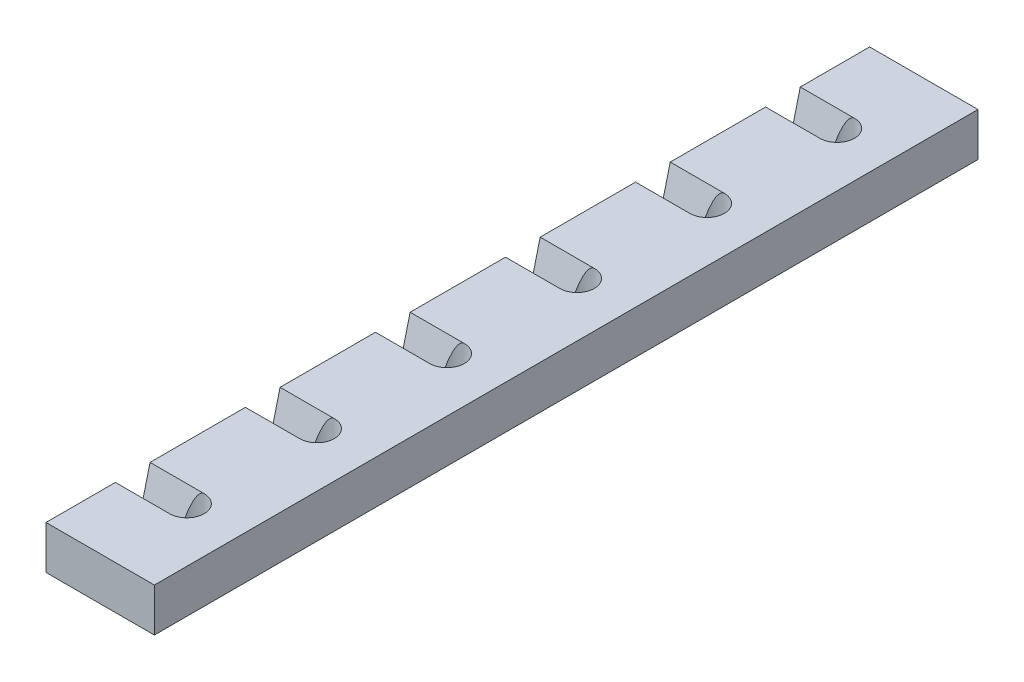
ISO-10303-21;
HEADER;
FILE_DESCRIPTION(('STEP AP214'),'2;1');
FILE_NAME('part.step','',(''),(''),'','','');
FILE_SCHEMA(('AUTOMOTIVE_DESIGN { 1 0 10303 214 1 1 1 1 }'));
ENDSEC;
DATA;
#1=APPLICATION_CONTEXT('core data for automotive mechanical design processes');
#2=APPLICATION_PROTOCOL_DEFINITION('international standard','automotive_design',2000,#1);
#3=PRODUCT_CONTEXT('',#1,'mechanical');
#4=PRODUCT('Part','Part','',(#3));
#5=PRODUCT_RELATED_PRODUCT_CATEGORY('part','',(#4));
#6=PRODUCT_DEFINITION_FORMATION('','',#4);
#7=PRODUCT_DEFINITION_CONTEXT('part definition',#1,'design');
#8=PRODUCT_DEFINITION('design','',#6,#7);
#9=PRODUCT_DEFINITION_SHAPE('','',#8);
#10=(LENGTH_UNIT() NAMED_UNIT(*) SI_UNIT(.MILLI.,.METRE.));
#11=(NAMED_UNIT(*) PLANE_ANGLE_UNIT() SI_UNIT($,.RADIAN.));
#12=(NAMED_UNIT(*) SI_UNIT($,.STERADIAN.) SOLID_ANGLE_UNIT());
#13=UNCERTAINTY_MEASURE_WITH_UNIT(LENGTH_MEASURE(1.E-05),#10,'distance_accuracy_value','');
#14=(GEOMETRIC_REPRESENTATION_CONTEXT(3) GLOBAL_UNCERTAINTY_ASSIGNED_CONTEXT((#13)) GLOBAL_UNIT_ASSIGNED_CONTEXT((#10,
#11,#12)) REPRESENTATION_CONTEXT('',''));
#15=CARTESIAN_POINT('',(0.,0.,0.));
#16=DIRECTION('',(0.,0.,1.));
#17=DIRECTION('',(1.,0.,0.));
#18=AXIS2_PLACEMENT_3D('',#15,#16,#17);
#19=CARTESIAN_POINT('',(-25.,-10.,-380.));
#20=DIRECTION('',(-1.,0.,0.));
#21=DIRECTION('',(0.,0.,1.));
#22=AXIS2_PLACEMENT_3D('',#19,#20,#21);
#23=PLANE('',#22);
#24=DIRECTION('',(0.,-0.970142500145332,0.242535625036331));
#25=VECTOR('',#24,1.);
#26=CARTESIAN_POINT('',(-25.,10.,-48.));
#27=LINE('',#26,#25);
#28=CARTESIAN_POINT('',(-25.,10.,-48.));
#29=VERTEX_POINT('',#28);
#30=CARTESIAN_POINT('',(-25.,-10.,-43.));
#31=VERTEX_POINT('',#30);
#32=EDGE_CURVE('E469',#29,#31,#27,.T.);
#33=ORIENTED_EDGE('',*,*,#32,.F.);
#34=DIRECTION('',(0.,0.,1.));
#35=VECTOR('',#34,1.);
#36=CARTESIAN_POINT('',(-25.,10.,-380.));
#37=LINE('',#36,#35);
#38=CARTESIAN_POINT('',(-25.,10.,-92.));
#39=VERTEX_POINT('',#38);
#40=EDGE_CURVE('E278',#39,#29,#37,.T.);
#41=ORIENTED_EDGE('',*,*,#40,.F.);
#42=DIRECTION('',(0.,0.970142500145331,0.242535625036336));
#43=VECTOR('',#42,1.);
#44=CARTESIAN_POINT('',(-25.,-10.,-97.));
#45=LINE('',#44,#43);
#46=CARTESIAN_POINT('',(-25.,-10.,-97.));
#47=VERTEX_POINT('',#46);
#48=EDGE_CURVE('E470',#47,#39,#45,.T.);
#49=ORIENTED_EDGE('',*,*,#48,.F.);
#50=DIRECTION('',(0.,0.,1.));
#51=VECTOR('',#50,1.);
#52=CARTESIAN_POINT('',(-25.,-10.,-380.));
#53=LINE('',#52,#51);
#54=EDGE_CURVE('E275',#47,#31,#53,.T.);
#55=ORIENTED_EDGE('',*,*,#54,.T.);
#56=EDGE_LOOP('',(#33,#41,#49,#55));
#57=FACE_BOUND('',#56,.T.);
#58=ADVANCED_FACE('F32',(#57),#23,.T.);
#59=DIRECTION('',(0.,-0.970142500145332,0.242535625036331));
#60=VECTOR('',#59,1.);
#61=CARTESIAN_POINT('',(-25.,10.,-108.));
#62=LINE('',#61,#60);
#63=CARTESIAN_POINT('',(-25.,10.,-108.));
#64=VERTEX_POINT('',#63);
#65=CARTESIAN_POINT('',(-25.,-10.,-103.));
#66=VERTEX_POINT('',#65);
#67=EDGE_CURVE('E478',#64,#66,#62,.T.);
#68=ORIENTED_EDGE('',*,*,#67,.F.);
#69=CARTESIAN_POINT('',(-25.,10.,-152.));
#70=VERTEX_POINT('',#69);
#71=EDGE_CURVE('E283',#70,#64,#37,.T.);
#72=ORIENTED_EDGE('',*,*,#71,.F.);
#73=DIRECTION('',(0.,0.970142500145331,0.242535625036336));
#74=VECTOR('',#73,1.);
#75=CARTESIAN_POINT('',(-25.,-10.,-157.));
#76=LINE('',#75,#74);
#77=CARTESIAN_POINT('',(-25.,-10.,-157.));
#78=VERTEX_POINT('',#77);
#79=EDGE_CURVE('E378',#78,#70,#76,.T.);
#80=ORIENTED_EDGE('',*,*,#79,.F.);
#81=EDGE_CURVE('E455',#78,#66,#53,.T.);
#82=ORIENTED_EDGE('',*,*,#81,.T.);
#83=EDGE_LOOP('',(#68,#72,#80,#82));
#84=FACE_BOUND('',#83,.T.);
#85=ADVANCED_FACE('F483',(#84),#23,.T.);
#86=DIRECTION('',(0.,-0.970142500145332,0.242535625036331));
#87=VECTOR('',#86,1.);
#88=CARTESIAN_POINT('',(-25.,10.,-168.));
#89=LINE('',#88,#87);
#90=CARTESIAN_POINT('',(-25.,10.,-168.));
#91=VERTEX_POINT('',#90);
#92=CARTESIAN_POINT('',(-25.,-10.,-163.));
#93=VERTEX_POINT('',#92);
#94=EDGE_CURVE('E381',#91,#93,#89,.T.);
#95=ORIENTED_EDGE('',*,*,#94,.F.);
#96=CARTESIAN_POINT('',(-25.,10.,-212.));
#97=VERTEX_POINT('',#96);
#98=EDGE_CURVE('E484',#97,#91,#37,.T.);
#99=ORIENTED_EDGE('',*,*,#98,.F.);
#100=DIRECTION('',(0.,0.970142500145331,0.242535625036336));
#101=VECTOR('',#100,1.);
#102=CARTESIAN_POINT('',(-25.,-10.,-217.));
#103=LINE('',#102,#101);
#104=CARTESIAN_POINT('',(-25.,-10.,-217.));
#105=VERTEX_POINT('',#104);
#106=EDGE_CURVE('E393',#105,#97,#103,.T.);
#107=ORIENTED_EDGE('',*,*,#106,.F.);
#108=EDGE_CURVE('E451',#105,#93,#53,.T.);
#109=ORIENTED_EDGE('',*,*,#108,.T.);
#110=EDGE_LOOP('',(#95,#99,#107,#109));
#111=FACE_BOUND('',#110,.T.);
#112=ADVANCED_FACE('F502',(#111),#23,.T.);
#113=DIRECTION('',(0.,-0.970142500145332,0.242535625036331));
#114=VECTOR('',#113,1.);
#115=CARTESIAN_POINT('',(-25.,10.,-228.));
#116=LINE('',#115,#114);
#117=CARTESIAN_POINT('',(-25.,10.,-228.));
#118=VERTEX_POINT('',#117);
#119=CARTESIAN_POINT('',(-25.,-10.,-223.));
#120=VERTEX_POINT('',#119);
#121=EDGE_CURVE('E396',#118,#120,#116,.T.);
#122=ORIENTED_EDGE('',*,*,#121,.F.);
#123=CARTESIAN_POINT('',(-25.,10.,-272.));
#124=VERTEX_POINT('',#123);
#125=EDGE_CURVE('E277',#124,#118,#37,.T.);
#126=ORIENTED_EDGE('',*,*,#125,.F.);
#127=DIRECTION('',(0.,0.970142500145331,0.242535625036336));
#128=VECTOR('',#127,1.);
#129=CARTESIAN_POINT('',(-25.,-10.,-277.));
#130=LINE('',#129,#128);
#131=CARTESIAN_POINT('',(-25.,-10.,-277.));
#132=VERTEX_POINT('',#131);
#133=EDGE_CURVE('E411',#132,#124,#130,.T.);
#134=ORIENTED_EDGE('',*,*,#133,.F.);
#135=EDGE_CURVE('E435',#132,#120,#53,.T.);
#136=ORIENTED_EDGE('',*,*,#135,.T.);
#137=EDGE_LOOP('',(#122,#126,#134,#136));
#138=FACE_BOUND('',#137,.T.);
#139=ADVANCED_FACE('F492',(#138),#23,.T.);
#140=DIRECTION('',(0.,-0.970142500145332,0.242535625036331));
#141=VECTOR('',#140,1.);
#142=CARTESIAN_POINT('',(-25.,10.,-288.));
#143=LINE('',#142,#141);
#144=CARTESIAN_POINT('',(-25.,10.,-288.));
#145=VERTEX_POINT('',#144);
#146=CARTESIAN_POINT('',(-25.,-10.,-283.));
#147=VERTEX_POINT('',#146);
#148=EDGE_CURVE('E414',#145,#147,#143,.T.);
#149=ORIENTED_EDGE('',*,*,#148,.F.);
#150=CARTESIAN_POINT('',(-25.,10.,-332.));
#151=VERTEX_POINT('',#150);
#152=EDGE_CURVE('E271',#151,#145,#37,.T.);
#153=ORIENTED_EDGE('',*,*,#152,.F.);
#154=DIRECTION('',(0.,0.970142500145331,0.242535625036336));
#155=VECTOR('',#154,1.);
#156=CARTESIAN_POINT('',(-25.,-10.,-337.));
#157=LINE('',#156,#155);
#158=CARTESIAN_POINT('',(-25.,-10.,-337.));
#159=VERTEX_POINT('',#158);
#160=EDGE_CURVE('E302',#159,#151,#157,.T.);
#161=ORIENTED_EDGE('',*,*,#160,.F.);
#162=EDGE_CURVE('E268',#159,#147,#53,.T.);
#163=ORIENTED_EDGE('',*,*,#162,.T.);
#164=EDGE_LOOP('',(#149,#153,#161,#163));
#165=FACE_BOUND('',#164,.T.);
#166=ADVANCED_FACE('F446',(#165),#23,.T.);
#167=DIRECTION('',(0.,-0.970142500145332,0.242535625036331));
#168=VECTOR('',#167,1.);
#169=CARTESIAN_POINT('',(-25.,10.,-348.));
#170=LINE('',#169,#168);
#171=CARTESIAN_POINT('',(-25.,10.,-348.));
#172=VERTEX_POINT('',#171);
#173=CARTESIAN_POINT('',(-25.,-10.,-343.));
#174=VERTEX_POINT('',#173);
#175=EDGE_CURVE('E299',#172,#174,#170,.T.);
#176=ORIENTED_EDGE('',*,*,#175,.F.);
#177=CARTESIAN_POINT('',(-25.,10.,-380.));
#178=VERTEX_POINT('',#177);
#179=EDGE_CURVE('E269',#178,#172,#37,.T.);
#180=ORIENTED_EDGE('',*,*,#179,.F.);
#181=DIRECTION('',(0.,-1.,0.));
#182=VECTOR('',#181,1.);
#183=CARTESIAN_POINT('',(-25.,-10.,-380.));
#184=LINE('',#183,#182);
#185=CARTESIAN_POINT('',(-25.,-10.,-380.));
#186=VERTEX_POINT('',#185);
#187=EDGE_CURVE('E254',#178,#186,#184,.T.);
#188=ORIENTED_EDGE('',*,*,#187,.T.);
#189=EDGE_CURVE('E41',#186,#174,#53,.T.);
#190=ORIENTED_EDGE('',*,*,#189,.T.);
#191=EDGE_LOOP('',(#176,#180,#188,#190));
#192=FACE_BOUND('',#191,.T.);
#193=ADVANCED_FACE('F298',(#192),#23,.T.);
#194=CARTESIAN_POINT('',(25.,-10.,-380.));
#195=DIRECTION('',(1.,0.,0.));
#196=DIRECTION('',(0.,0.,-1.));
#197=AXIS2_PLACEMENT_3D('',#194,#195,#196);
#198=PLANE('',#197);
#199=DIRECTION('',(0.,1.,0.));
#200=VECTOR('',#199,1.);
#201=CARTESIAN_POINT('',(25.,-10.,0.));
#202=LINE('',#201,#200);
#203=CARTESIAN_POINT('',(25.,-10.,0.));
#204=VERTEX_POINT('',#203);
#205=CARTESIAN_POINT('',(25.,10.,0.));
#206=VERTEX_POINT('',#205);
#207=EDGE_CURVE('E235',#204,#206,#202,.T.);
#208=ORIENTED_EDGE('',*,*,#207,.F.);
#209=DIRECTION('',(0.,0.,1.));
#210=VECTOR('',#209,1.);
#211=CARTESIAN_POINT('',(25.,-10.,-380.));
#212=LINE('',#211,#210);
#213=CARTESIAN_POINT('',(25.,-10.,-380.));
#214=VERTEX_POINT('',#213);
#215=EDGE_CURVE('E11',#214,#204,#212,.T.);
#216=ORIENTED_EDGE('',*,*,#215,.F.);
#217=DIRECTION('',(0.,1.,0.));
#218=VECTOR('',#217,1.);
#219=CARTESIAN_POINT('',(25.,-10.,-380.));
#220=LINE('',#219,#218);
#221=CARTESIAN_POINT('',(25.,10.,-380.));
#222=VERTEX_POINT('',#221);
#223=EDGE_CURVE('E247',#214,#222,#220,.T.);
#224=ORIENTED_EDGE('',*,*,#223,.T.);
#225=DIRECTION('',(0.,0.,1.));
#226=VECTOR('',#225,1.);
#227=CARTESIAN_POINT('',(25.,10.,-380.));
#228=LINE('',#227,#226);
#229=EDGE_CURVE('E36',#222,#206,#228,.T.);
#230=ORIENTED_EDGE('',*,*,#229,.T.);
#231=EDGE_LOOP('',(#208,#216,#224,#230));
#232=FACE_BOUND('',#231,.T.);
#233=ADVANCED_FACE('F34',(#232),#198,.T.);
#234=CARTESIAN_POINT('',(-25.,-10.,-380.));
#235=DIRECTION('',(0.,-1.,0.));
#236=DIRECTION('',(0.,0.,-1.));
#237=AXIS2_PLACEMENT_3D('',#234,#235,#236);
#238=PLANE('',#237);
#239=DIRECTION('',(-1.,0.,0.));
#240=VECTOR('',#239,1.);
#241=CARTESIAN_POINT('',(25.001,-10.,-43.));
#242=LINE('',#241,#240);
#243=CARTESIAN_POINT('',(-7.41619848709565,-10.,-43.));
#244=VERTEX_POINT('',#243);
#245=EDGE_CURVE('E57',#244,#31,#242,.T.);
#246=ORIENTED_EDGE('',*,*,#245,.T.);
#247=ORIENTED_EDGE('',*,*,#54,.F.);
#248=DIRECTION('',(-1.,0.,0.));
#249=VECTOR('',#248,1.);
#250=CARTESIAN_POINT('',(25.001,-10.,-97.));
#251=LINE('',#250,#249);
#252=CARTESIAN_POINT('',(-7.41619848709567,-10.,-97.));
#253=VERTEX_POINT('',#252);
#254=EDGE_CURVE('E370',#253,#47,#251,.T.);
#255=ORIENTED_EDGE('',*,*,#254,.F.);
#256=CARTESIAN_POINT('',(0.,-10.,-100.));
#257=DIRECTION('',(0.,1.,0.));
#258=DIRECTION('',(0.,0.,1.));
#259=AXIS2_PLACEMENT_3D('',#256,#257,#258);
#260=CIRCLE('',#259,8.);
#261=CARTESIAN_POINT('',(-7.41619848709565,-10.,-103.));
#262=VERTEX_POINT('',#261);
#263=EDGE_CURVE('E241',#253,#262,#260,.T.);
#264=ORIENTED_EDGE('',*,*,#263,.T.);
#265=DIRECTION('',(-1.,0.,0.));
#266=VECTOR('',#265,1.);
#267=CARTESIAN_POINT('',(25.001,-10.,-103.));
#268=LINE('',#267,#266);
#269=EDGE_CURVE('E374',#262,#66,#268,.T.);
#270=ORIENTED_EDGE('',*,*,#269,.T.);
#271=ORIENTED_EDGE('',*,*,#81,.F.);
#272=DIRECTION('',(-1.,0.,0.));
#273=VECTOR('',#272,1.);
#274=CARTESIAN_POINT('',(25.001,-10.,-157.));
#275=LINE('',#274,#273);
#276=CARTESIAN_POINT('',(-7.41619848709567,-10.,-157.));
#277=VERTEX_POINT('',#276);
#278=EDGE_CURVE('E387',#277,#78,#275,.T.);
#279=ORIENTED_EDGE('',*,*,#278,.F.);
#280=CARTESIAN_POINT('',(0.,-10.,-160.));
#281=DIRECTION('',(0.,1.,0.));
#282=DIRECTION('',(0.,0.,1.));
#283=AXIS2_PLACEMENT_3D('',#280,#281,#282);
#284=CIRCLE('',#283,8.);
#285=CARTESIAN_POINT('',(-7.41619848709565,-10.,-163.));
#286=VERTEX_POINT('',#285);
#287=EDGE_CURVE('E340',#277,#286,#284,.T.);
#288=ORIENTED_EDGE('',*,*,#287,.T.);
#289=DIRECTION('',(-1.,0.,0.));
#290=VECTOR('',#289,1.);
#291=CARTESIAN_POINT('',(25.001,-10.,-163.));
#292=LINE('',#291,#290);
#293=EDGE_CURVE('E380',#286,#93,#292,.T.);
#294=ORIENTED_EDGE('',*,*,#293,.T.);
#295=ORIENTED_EDGE('',*,*,#108,.F.);
#296=DIRECTION('',(-1.,0.,0.));
#297=VECTOR('',#296,1.);
#298=CARTESIAN_POINT('',(25.001,-10.,-217.));
#299=LINE('',#298,#297);
#300=CARTESIAN_POINT('',(-7.41619848709567,-10.,-217.));
#301=VERTEX_POINT('',#300);
#302=EDGE_CURVE('E404',#301,#105,#299,.T.);
#303=ORIENTED_EDGE('',*,*,#302,.F.);
#304=CARTESIAN_POINT('',(0.,-10.,-220.));
#305=DIRECTION('',(0.,1.,0.));
#306=DIRECTION('',(0.,0.,1.));
#307=AXIS2_PLACEMENT_3D('',#304,#305,#306);
#308=CIRCLE('',#307,8.);
#309=CARTESIAN_POINT('',(-7.41619848709565,-10.,-223.));
#310=VERTEX_POINT('',#309);
#311=EDGE_CURVE('E334',#301,#310,#308,.T.);
#312=ORIENTED_EDGE('',*,*,#311,.T.);
#313=DIRECTION('',(-1.,0.,0.));
#314=VECTOR('',#313,1.);
#315=CARTESIAN_POINT('',(25.001,-10.,-223.));
#316=LINE('',#315,#314);
#317=EDGE_CURVE('E395',#310,#120,#316,.T.);
#318=ORIENTED_EDGE('',*,*,#317,.T.);
#319=ORIENTED_EDGE('',*,*,#135,.F.);
#320=DIRECTION('',(-1.,0.,0.));
#321=VECTOR('',#320,1.);
#322=CARTESIAN_POINT('',(25.001,-10.,-277.));
#323=LINE('',#322,#321);
#324=CARTESIAN_POINT('',(-7.41619848709566,-10.,-277.));
#325=VERTEX_POINT('',#324);
#326=EDGE_CURVE('E421',#325,#132,#323,.T.);
#327=ORIENTED_EDGE('',*,*,#326,.F.);
#328=CARTESIAN_POINT('',(0.,-10.,-280.));
#329=DIRECTION('',(0.,1.,0.));
#330=DIRECTION('',(0.,0.,1.));
#331=AXIS2_PLACEMENT_3D('',#328,#329,#330);
#332=CIRCLE('',#331,8.);
#333=CARTESIAN_POINT('',(-7.41619848709566,-10.,-283.));
#334=VERTEX_POINT('',#333);
#335=EDGE_CURVE('E328',#325,#334,#332,.T.);
#336=ORIENTED_EDGE('',*,*,#335,.T.);
#337=DIRECTION('',(-1.,0.,0.));
#338=VECTOR('',#337,1.);
#339=CARTESIAN_POINT('',(25.001,-10.,-283.));
#340=LINE('',#339,#338);
#341=EDGE_CURVE('E413',#334,#147,#340,.T.);
#342=ORIENTED_EDGE('',*,*,#341,.T.);
#343=ORIENTED_EDGE('',*,*,#162,.F.);
#344=DIRECTION('',(-1.,0.,0.));
#345=VECTOR('',#344,1.);
#346=CARTESIAN_POINT('',(25.001,-10.,-337.));
#347=LINE('',#346,#345);
#348=CARTESIAN_POINT('',(-7.41619848709566,-10.,-337.));
#349=VERTEX_POINT('',#348);
#350=EDGE_CURVE('E315',#349,#159,#347,.T.);
#351=ORIENTED_EDGE('',*,*,#350,.F.);
#352=CARTESIAN_POINT('',(0.,-10.,-340.));
#353=DIRECTION('',(0.,1.,0.));
#354=DIRECTION('',(0.,0.,1.));
#355=AXIS2_PLACEMENT_3D('',#352,#353,#354);
#356=CIRCLE('',#355,8.);
#357=CARTESIAN_POINT('',(-7.41619848709566,-10.,-343.));
#358=VERTEX_POINT('',#357);
#359=EDGE_CURVE('E322',#349,#358,#356,.T.);
#360=ORIENTED_EDGE('',*,*,#359,.T.);
#361=DIRECTION('',(-1.,0.,0.));
#362=VECTOR('',#361,1.);
#363=CARTESIAN_POINT('',(25.001,-10.,-343.));
#364=LINE('',#363,#362);
#365=EDGE_CURVE('E305',#358,#174,#364,.T.);
#366=ORIENTED_EDGE('',*,*,#365,.T.);
#367=ORIENTED_EDGE('',*,*,#189,.F.);
#368=DIRECTION('',(1.,0.,0.));
#369=VECTOR('',#368,1.);
#370=CARTESIAN_POINT('',(-25.,-10.,-380.));
#371=LINE('',#370,#369);
#372=EDGE_CURVE('E257',#186,#214,#371,.T.);
#373=ORIENTED_EDGE('',*,*,#372,.T.);
#374=ORIENTED_EDGE('',*,*,#215,.T.);
#375=DIRECTION('',(1.,0.,0.));
#376=VECTOR('',#375,1.);
#377=CARTESIAN_POINT('',(-25.,-10.,0.));
#378=LINE('',#377,#376);
#379=CARTESIAN_POINT('',(-25.,-10.,0.));
#380=VERTEX_POINT('',#379);
#381=EDGE_CURVE('E251',#380,#204,#378,.T.);
#382=ORIENTED_EDGE('',*,*,#381,.F.);
#383=CARTESIAN_POINT('',(-25.,-10.,-37.));
#384=VERTEX_POINT('',#383);
#385=EDGE_CURVE('E232',#384,#380,#53,.T.);
#386=ORIENTED_EDGE('',*,*,#385,.F.);
#387=DIRECTION('',(-1.,0.,0.));
#388=VECTOR('',#387,1.);
#389=CARTESIAN_POINT('',(25.001,-10.,-37.));
#390=LINE('',#389,#388);
#391=CARTESIAN_POINT('',(-7.41619848709568,-10.,-37.));
#392=VERTEX_POINT('',#391);
#393=EDGE_CURVE('E218',#392,#384,#390,.T.);
#394=ORIENTED_EDGE('',*,*,#393,.F.);
#395=CARTESIAN_POINT('',(0.,-10.,-40.));
#396=DIRECTION('',(0.,1.,0.));
#397=DIRECTION('',(0.,0.,1.));
#398=AXIS2_PLACEMENT_3D('',#395,#396,#397);
#399=CIRCLE('',#398,8.);
#400=EDGE_CURVE('E230',#392,#244,#399,.T.);
#401=ORIENTED_EDGE('',*,*,#400,.T.);
#402=EDGE_LOOP('',(#246,#247,#255,#264,#270,#271,#279,#288,#294,#295,#303,#312,#318,#319,#327,
#336,#342,#343,#351,#360,#366,#367,#373,#374,#382,#386,#394,#401));
#403=FACE_BOUND('',#402,.T.);
#404=ADVANCED_FACE('F229',(#403),#238,.T.);
#405=DIRECTION('',(0.,0.970142500145331,0.242535625036336));
#406=VECTOR('',#405,1.);
#407=CARTESIAN_POINT('',(-25.,-10.,-37.));
#408=LINE('',#407,#406);
#409=CARTESIAN_POINT('',(-25.,10.,-32.));
#410=VERTEX_POINT('',#409);
#411=EDGE_CURVE('E471',#384,#410,#408,.T.);
#412=ORIENTED_EDGE('',*,*,#411,.F.);
#413=ORIENTED_EDGE('',*,*,#385,.T.);
#414=DIRECTION('',(0.,-1.,0.));
#415=VECTOR('',#414,1.);
#416=CARTESIAN_POINT('',(-25.,-10.,0.));
#417=LINE('',#416,#415);
#418=CARTESIAN_POINT('',(-25.,10.,0.));
#419=VERTEX_POINT('',#418);
#420=EDGE_CURVE('E262',#419,#380,#417,.T.);
#421=ORIENTED_EDGE('',*,*,#420,.F.);
#422=EDGE_CURVE('E272',#410,#419,#37,.T.);
#423=ORIENTED_EDGE('',*,*,#422,.F.);
#424=EDGE_LOOP('',(#412,#413,#421,#423));
#425=FACE_BOUND('',#424,.T.);
#426=ADVANCED_FACE('F526',(#425),#23,.T.);
#427=CARTESIAN_POINT('',(-25.,10.,-380.));
#428=DIRECTION('',(0.,1.,0.));
#429=DIRECTION('',(0.,0.,1.));
#430=AXIS2_PLACEMENT_3D('',#427,#428,#429);
#431=PLANE('',#430);
#432=DIRECTION('',(-1.,0.,0.));
#433=VECTOR('',#432,1.);
#434=CARTESIAN_POINT('',(25.001,10.,-48.));
#435=LINE('',#434,#433);
#436=CARTESIAN_POINT('',(0.,10.,-48.));
#437=VERTEX_POINT('',#436);
#438=EDGE_CURVE('E377',#437,#29,#435,.T.);
#439=ORIENTED_EDGE('',*,*,#438,.F.);
#440=CARTESIAN_POINT('',(0.,10.,-40.));
#441=DIRECTION('',(0.,1.,0.));
#442=DIRECTION('',(0.,0.,1.));
#443=AXIS2_PLACEMENT_3D('',#440,#441,#442);
#444=CIRCLE('',#443,8.);
#445=CARTESIAN_POINT('',(0.,10.,-32.));
#446=VERTEX_POINT('',#445);
#447=EDGE_CURVE('E236',#446,#437,#444,.T.);
#448=ORIENTED_EDGE('',*,*,#447,.F.);
#449=DIRECTION('',(-1.,0.,0.));
#450=VECTOR('',#449,1.);
#451=CARTESIAN_POINT('',(25.001,10.,-32.));
#452=LINE('',#451,#450);
#453=EDGE_CURVE('E49',#446,#410,#452,.T.);
#454=ORIENTED_EDGE('',*,*,#453,.T.);
#455=ORIENTED_EDGE('',*,*,#422,.T.);
#456=DIRECTION('',(-1.,0.,0.));
#457=VECTOR('',#456,1.);
#458=CARTESIAN_POINT('',(-25.,10.,0.));
#459=LINE('',#458,#457);
#460=EDGE_CURVE('E239',#206,#419,#459,.T.);
#461=ORIENTED_EDGE('',*,*,#460,.F.);
#462=ORIENTED_EDGE('',*,*,#229,.F.);
#463=DIRECTION('',(-1.,0.,0.));
#464=VECTOR('',#463,1.);
#465=CARTESIAN_POINT('',(-25.,10.,-380.));
#466=LINE('',#465,#464);
#467=EDGE_CURVE('E250',#222,#178,#466,.T.);
#468=ORIENTED_EDGE('',*,*,#467,.T.);
#469=ORIENTED_EDGE('',*,*,#179,.T.);
#470=DIRECTION('',(-1.,0.,0.));
#471=VECTOR('',#470,1.);
#472=CARTESIAN_POINT('',(25.001,10.,-348.));
#473=LINE('',#472,#471);
#474=CARTESIAN_POINT('',(0.,10.0000000000001,-348.));
#475=VERTEX_POINT('',#474);
#476=EDGE_CURVE('E314',#475,#172,#473,.T.);
#477=ORIENTED_EDGE('',*,*,#476,.F.);
#478=CARTESIAN_POINT('',(0.,10.,-340.));
#479=DIRECTION('',(0.,1.,0.));
#480=DIRECTION('',(0.,0.,1.));
#481=AXIS2_PLACEMENT_3D('',#478,#479,#480);
#482=CIRCLE('',#481,8.);
#483=CARTESIAN_POINT('',(0.,10.,-332.));
#484=VERTEX_POINT('',#483);
#485=EDGE_CURVE('E319',#484,#475,#482,.T.);
#486=ORIENTED_EDGE('',*,*,#485,.F.);
#487=DIRECTION('',(-1.,0.,0.));
#488=VECTOR('',#487,1.);
#489=CARTESIAN_POINT('',(25.001,10.,-332.));
#490=LINE('',#489,#488);
#491=EDGE_CURVE('E311',#484,#151,#490,.T.);
#492=ORIENTED_EDGE('',*,*,#491,.T.);
#493=ORIENTED_EDGE('',*,*,#152,.T.);
#494=DIRECTION('',(-1.,0.,0.));
#495=VECTOR('',#494,1.);
#496=CARTESIAN_POINT('',(25.001,10.,-288.));
#497=LINE('',#496,#495);
#498=CARTESIAN_POINT('',(0.,10.0000000000001,-288.));
#499=VERTEX_POINT('',#498);
#500=EDGE_CURVE('E321',#499,#145,#497,.T.);
#501=ORIENTED_EDGE('',*,*,#500,.F.);
#502=CARTESIAN_POINT('',(0.,10.,-280.));
#503=DIRECTION('',(0.,1.,0.));
#504=DIRECTION('',(0.,0.,1.));
#505=AXIS2_PLACEMENT_3D('',#502,#503,#504);
#506=CIRCLE('',#505,8.);
#507=CARTESIAN_POINT('',(0.,10.,-272.));
#508=VERTEX_POINT('',#507);
#509=EDGE_CURVE('E325',#508,#499,#506,.T.);
#510=ORIENTED_EDGE('',*,*,#509,.F.);
#511=DIRECTION('',(-1.,0.,0.));
#512=VECTOR('',#511,1.);
#513=CARTESIAN_POINT('',(25.001,10.,-272.));
#514=LINE('',#513,#512);
#515=EDGE_CURVE('E418',#508,#124,#514,.T.);
#516=ORIENTED_EDGE('',*,*,#515,.T.);
#517=ORIENTED_EDGE('',*,*,#125,.T.);
#518=DIRECTION('',(-1.,0.,0.));
#519=VECTOR('',#518,1.);
#520=CARTESIAN_POINT('',(25.001,10.,-228.));
#521=LINE('',#520,#519);
#522=CARTESIAN_POINT('',(0.,10.,-228.));
#523=VERTEX_POINT('',#522);
#524=EDGE_CURVE('E403',#523,#118,#521,.T.);
#525=ORIENTED_EDGE('',*,*,#524,.F.);
#526=CARTESIAN_POINT('',(0.,10.,-220.));
#527=DIRECTION('',(0.,1.,0.));
#528=DIRECTION('',(0.,0.,1.));
#529=AXIS2_PLACEMENT_3D('',#526,#527,#528);
#530=CIRCLE('',#529,8.);
#531=CARTESIAN_POINT('',(0.,10.,-212.));
#532=VERTEX_POINT('',#531);
#533=EDGE_CURVE('E331',#532,#523,#530,.T.);
#534=ORIENTED_EDGE('',*,*,#533,.F.);
#535=DIRECTION('',(-1.,0.,0.));
#536=VECTOR('',#535,1.);
#537=CARTESIAN_POINT('',(25.001,10.,-212.));
#538=LINE('',#537,#536);
#539=EDGE_CURVE('E400',#532,#97,#538,.T.);
#540=ORIENTED_EDGE('',*,*,#539,.T.);
#541=ORIENTED_EDGE('',*,*,#98,.T.);
#542=DIRECTION('',(-1.,0.,0.));
#543=VECTOR('',#542,1.);
#544=CARTESIAN_POINT('',(25.001,10.,-168.));
#545=LINE('',#544,#543);
#546=CARTESIAN_POINT('',(0.,10.,-168.));
#547=VERTEX_POINT('',#546);
#548=EDGE_CURVE('E386',#547,#91,#545,.T.);
#549=ORIENTED_EDGE('',*,*,#548,.F.);
#550=CARTESIAN_POINT('',(0.,10.,-160.));
#551=DIRECTION('',(0.,1.,0.));
#552=DIRECTION('',(0.,0.,1.));
#553=AXIS2_PLACEMENT_3D('',#550,#551,#552);
#554=CIRCLE('',#553,8.);
#555=CARTESIAN_POINT('',(0.,10.,-152.));
#556=VERTEX_POINT('',#555);
#557=EDGE_CURVE('E337',#556,#547,#554,.T.);
#558=ORIENTED_EDGE('',*,*,#557,.F.);
#559=DIRECTION('',(-1.,0.,0.));
#560=VECTOR('',#559,1.);
#561=CARTESIAN_POINT('',(25.001,10.,-152.));
#562=LINE('',#561,#560);
#563=EDGE_CURVE('E384',#556,#70,#562,.T.);
#564=ORIENTED_EDGE('',*,*,#563,.T.);
#565=ORIENTED_EDGE('',*,*,#71,.T.);
#566=DIRECTION('',(-1.,0.,0.));
#567=VECTOR('',#566,1.);
#568=CARTESIAN_POINT('',(25.001,10.,-108.));
#569=LINE('',#568,#567);
#570=CARTESIAN_POINT('',(0.,10.,-108.));
#571=VERTEX_POINT('',#570);
#572=EDGE_CURVE('E361',#571,#64,#569,.T.);
#573=ORIENTED_EDGE('',*,*,#572,.F.);
#574=CARTESIAN_POINT('',(0.,10.,-100.));
#575=DIRECTION('',(0.,1.,0.));
#576=DIRECTION('',(0.,0.,1.));
#577=AXIS2_PLACEMENT_3D('',#574,#575,#576);
#578=CIRCLE('',#577,8.);
#579=CARTESIAN_POINT('',(0.,10.,-92.));
#580=VERTEX_POINT('',#579);
#581=EDGE_CURVE('E244',#580,#571,#578,.T.);
#582=ORIENTED_EDGE('',*,*,#581,.F.);
#583=DIRECTION('',(-1.,0.,0.));
#584=VECTOR('',#583,1.);
#585=CARTESIAN_POINT('',(25.001,10.,-92.));
#586=LINE('',#585,#584);
#587=EDGE_CURVE('E358',#580,#39,#586,.T.);
#588=ORIENTED_EDGE('',*,*,#587,.T.);
#589=ORIENTED_EDGE('',*,*,#40,.T.);
#590=EDGE_LOOP('',(#439,#448,#454,#455,#461,#462,#468,#469,#477,#486,#492,#493,#501,#510,#516,
#517,#525,#534,#540,#541,#549,#558,#564,#565,#573,#582,#588,#589));
#591=FACE_BOUND('',#590,.T.);
#592=ADVANCED_FACE('F289',(#591),#431,.T.);
#593=CARTESIAN_POINT('',(0.,0.,-380.));
#594=DIRECTION('',(0.,0.,-1.));
#595=DIRECTION('',(-1.,0.,0.));
#596=AXIS2_PLACEMENT_3D('',#593,#594,#595);
#597=PLANE('',#596);
#598=ORIENTED_EDGE('',*,*,#223,.F.);
#599=ORIENTED_EDGE('',*,*,#372,.F.);
#600=ORIENTED_EDGE('',*,*,#187,.F.);
#601=ORIENTED_EDGE('',*,*,#467,.F.);
#602=EDGE_LOOP('',(#598,#599,#600,#601));
#603=FACE_BOUND('',#602,.T.);
#604=ADVANCED_FACE('F294',(#603),#597,.T.);
#605=CARTESIAN_POINT('',(0.,0.,0.));
#606=DIRECTION('',(0.,0.,-1.));
#607=DIRECTION('',(-1.,0.,0.));
#608=AXIS2_PLACEMENT_3D('',#605,#606,#607);
#609=PLANE('',#608);
#610=ORIENTED_EDGE('',*,*,#207,.T.);
#611=ORIENTED_EDGE('',*,*,#460,.T.);
#612=ORIENTED_EDGE('',*,*,#420,.T.);
#613=ORIENTED_EDGE('',*,*,#381,.T.);
#614=EDGE_LOOP('',(#610,#611,#612,#613));
#615=FACE_BOUND('',#614,.T.);
#616=ADVANCED_FACE('F291',(#615),#609,.F.);
#617=CARTESIAN_POINT('',(0.,-10.,-40.));
#618=DIRECTION('',(0.,1.,0.));
#619=DIRECTION('',(0.,0.,1.));
#620=AXIS2_PLACEMENT_3D('',#617,#618,#619);
#621=CYLINDRICAL_SURFACE('',#620,8.);
#622=ORIENTED_EDGE('',*,*,#447,.T.);
#623=CARTESIAN_POINT('',(0.,-22.0000000000003,-40.));
#624=DIRECTION('',(0.,-0.242535625036331,-0.970142500145333));
#625=DIRECTION('',(0.,0.970142500145333,-0.242535625036331));
#626=AXIS2_PLACEMENT_3D('',#623,#624,#625);
#627=ELLIPSE('',#626,32.9848450049416,8.);
#628=EDGE_CURVE('E224',#244,#437,#627,.T.);
#629=ORIENTED_EDGE('',*,*,#628,.F.);
#630=ORIENTED_EDGE('',*,*,#400,.F.);
#631=CARTESIAN_POINT('',(0.,-21.9999999999997,-40.));
#632=DIRECTION('',(0.,-0.242535625036336,0.970142500145331));
#633=DIRECTION('',(0.,0.970142500145331,0.242535625036336));
#634=AXIS2_PLACEMENT_3D('',#631,#632,#633);
#635=ELLIPSE('',#634,32.9848450049409,8.);
#636=EDGE_CURVE('E215',#446,#392,#635,.T.);
#637=ORIENTED_EDGE('',*,*,#636,.F.);
#638=EDGE_LOOP('',(#622,#629,#630,#637));
#639=FACE_BOUND('',#638,.T.);
#640=ADVANCED_FACE('F234',(#639),#621,.F.);
#641=CARTESIAN_POINT('',(0.,-10.,-100.));
#642=DIRECTION('',(0.,1.,0.));
#643=DIRECTION('',(0.,0.,1.));
#644=AXIS2_PLACEMENT_3D('',#641,#642,#643);
#645=CYLINDRICAL_SURFACE('',#644,8.);
#646=ORIENTED_EDGE('',*,*,#581,.T.);
#647=CARTESIAN_POINT('',(0.,-22.0000000000002,-100.));
#648=DIRECTION('',(0.,-0.242535625036331,-0.970142500145333));
#649=DIRECTION('',(0.,0.970142500145333,-0.242535625036331));
#650=AXIS2_PLACEMENT_3D('',#647,#648,#649);
#651=ELLIPSE('',#650,32.9848450049416,8.);
#652=EDGE_CURVE('E354',#262,#571,#651,.T.);
#653=ORIENTED_EDGE('',*,*,#652,.F.);
#654=ORIENTED_EDGE('',*,*,#263,.F.);
#655=CARTESIAN_POINT('',(0.,-21.9999999999998,-100.));
#656=DIRECTION('',(0.,-0.242535625036336,0.970142500145331));
#657=DIRECTION('',(0.,0.970142500145331,0.242535625036336));
#658=AXIS2_PLACEMENT_3D('',#655,#656,#657);
#659=ELLIPSE('',#658,32.9848450049409,8.);
#660=EDGE_CURVE('E355',#580,#253,#659,.T.);
#661=ORIENTED_EDGE('',*,*,#660,.F.);
#662=EDGE_LOOP('',(#646,#653,#654,#661));
#663=FACE_BOUND('',#662,.T.);
#664=ADVANCED_FACE('F353',(#663),#645,.F.);
#665=CARTESIAN_POINT('',(0.,-10.,-160.));
#666=DIRECTION('',(0.,1.,0.));
#667=DIRECTION('',(0.,0.,1.));
#668=AXIS2_PLACEMENT_3D('',#665,#666,#667);
#669=CYLINDRICAL_SURFACE('',#668,8.);
#670=ORIENTED_EDGE('',*,*,#557,.T.);
#671=CARTESIAN_POINT('',(0.,-22.0000000000002,-160.));
#672=DIRECTION('',(0.,-0.242535625036331,-0.970142500145333));
#673=DIRECTION('',(0.,0.970142500145333,-0.242535625036331));
#674=AXIS2_PLACEMENT_3D('',#671,#672,#673);
#675=ELLIPSE('',#674,32.9848450049416,8.);
#676=EDGE_CURVE('E368',#286,#547,#675,.T.);
#677=ORIENTED_EDGE('',*,*,#676,.F.);
#678=ORIENTED_EDGE('',*,*,#287,.F.);
#679=CARTESIAN_POINT('',(0.,-21.9999999999998,-160.));
#680=DIRECTION('',(0.,-0.242535625036336,0.970142500145331));
#681=DIRECTION('',(0.,0.970142500145331,0.242535625036336));
#682=AXIS2_PLACEMENT_3D('',#679,#680,#681);
#683=ELLIPSE('',#682,32.9848450049409,8.);
#684=EDGE_CURVE('E366',#556,#277,#683,.T.);
#685=ORIENTED_EDGE('',*,*,#684,.F.);
#686=EDGE_LOOP('',(#670,#677,#678,#685));
#687=FACE_BOUND('',#686,.T.);
#688=ADVANCED_FACE('F509',(#687),#669,.F.);
#689=CARTESIAN_POINT('',(0.,-10.,-220.));
#690=DIRECTION('',(0.,1.,0.));
#691=DIRECTION('',(0.,0.,1.));
#692=AXIS2_PLACEMENT_3D('',#689,#690,#691);
#693=CYLINDRICAL_SURFACE('',#692,8.);
#694=ORIENTED_EDGE('',*,*,#533,.T.);
#695=CARTESIAN_POINT('',(0.,-22.0000000000002,-220.));
#696=DIRECTION('',(0.,-0.242535625036331,-0.970142500145333));
#697=DIRECTION('',(0.,0.970142500145333,-0.242535625036331));
#698=AXIS2_PLACEMENT_3D('',#695,#696,#697);
#699=ELLIPSE('',#698,32.9848450049416,8.);
#700=EDGE_CURVE('E398',#310,#523,#699,.T.);
#701=ORIENTED_EDGE('',*,*,#700,.F.);
#702=ORIENTED_EDGE('',*,*,#311,.F.);
#703=CARTESIAN_POINT('',(0.,-21.9999999999998,-220.));
#704=DIRECTION('',(0.,-0.242535625036336,0.970142500145331));
#705=DIRECTION('',(0.,0.970142500145331,0.242535625036336));
#706=AXIS2_PLACEMENT_3D('',#703,#704,#705);
#707=ELLIPSE('',#706,32.9848450049409,8.);
#708=EDGE_CURVE('E391',#532,#301,#707,.T.);
#709=ORIENTED_EDGE('',*,*,#708,.F.);
#710=EDGE_LOOP('',(#694,#701,#702,#709));
#711=FACE_BOUND('',#710,.T.);
#712=ADVANCED_FACE('F500',(#711),#693,.F.);
#713=CARTESIAN_POINT('',(0.,-10.,-280.));
#714=DIRECTION('',(0.,1.,0.));
#715=DIRECTION('',(0.,0.,1.));
#716=AXIS2_PLACEMENT_3D('',#713,#714,#715);
#717=CYLINDRICAL_SURFACE('',#716,8.);
#718=ORIENTED_EDGE('',*,*,#509,.T.);
#719=CARTESIAN_POINT('',(0.,-22.0000000000001,-280.));
#720=DIRECTION('',(0.,-0.242535625036331,-0.970142500145333));
#721=DIRECTION('',(0.,0.970142500145333,-0.242535625036331));
#722=AXIS2_PLACEMENT_3D('',#719,#720,#721);
#723=ELLIPSE('',#722,32.9848450049416,8.);
#724=EDGE_CURVE('E416',#334,#499,#723,.T.);
#725=ORIENTED_EDGE('',*,*,#724,.F.);
#726=ORIENTED_EDGE('',*,*,#335,.F.);
#727=CARTESIAN_POINT('',(0.,-21.9999999999999,-280.));
#728=DIRECTION('',(0.,-0.242535625036336,0.970142500145331));
#729=DIRECTION('',(0.,0.970142500145331,0.242535625036336));
#730=AXIS2_PLACEMENT_3D('',#727,#728,#729);
#731=ELLIPSE('',#730,32.9848450049409,8.);
#732=EDGE_CURVE('E409',#508,#325,#731,.T.);
#733=ORIENTED_EDGE('',*,*,#732,.F.);
#734=EDGE_LOOP('',(#718,#725,#726,#733));
#735=FACE_BOUND('',#734,.T.);
#736=ADVANCED_FACE('F437',(#735),#717,.F.);
#737=CARTESIAN_POINT('',(0.,-10.,-340.));
#738=DIRECTION('',(0.,1.,0.));
#739=DIRECTION('',(0.,0.,1.));
#740=AXIS2_PLACEMENT_3D('',#737,#738,#739);
#741=CYLINDRICAL_SURFACE('',#740,8.);
#742=ORIENTED_EDGE('',*,*,#485,.T.);
#743=CARTESIAN_POINT('',(0.,-22.0000000000001,-340.));
#744=DIRECTION('',(0.,-0.242535625036331,-0.970142500145333));
#745=DIRECTION('',(0.,0.970142500145333,-0.242535625036331));
#746=AXIS2_PLACEMENT_3D('',#743,#744,#745);
#747=ELLIPSE('',#746,32.9848450049416,8.);
#748=EDGE_CURVE('E303',#358,#475,#747,.T.);
#749=ORIENTED_EDGE('',*,*,#748,.F.);
#750=ORIENTED_EDGE('',*,*,#359,.F.);
#751=CARTESIAN_POINT('',(0.,-21.9999999999999,-340.));
#752=DIRECTION('',(0.,-0.242535625036336,0.970142500145331));
#753=DIRECTION('',(0.,0.970142500145331,0.242535625036336));
#754=AXIS2_PLACEMENT_3D('',#751,#752,#753);
#755=ELLIPSE('',#754,32.9848450049409,8.);
#756=EDGE_CURVE('E307',#484,#349,#755,.T.);
#757=ORIENTED_EDGE('',*,*,#756,.F.);
#758=EDGE_LOOP('',(#742,#749,#750,#757));
#759=FACE_BOUND('',#758,.T.);
#760=ADVANCED_FACE('F572',(#759),#741,.F.);
#761=CARTESIAN_POINT('',(25.001,-10.,-337.));
#762=DIRECTION('',(0.,-0.242535625036336,0.970142500145331));
#763=DIRECTION('',(0.,-0.970142500145331,-0.242535625036336));
#764=AXIS2_PLACEMENT_3D('',#761,#762,#763);
#765=PLANE('',#764);
#766=ORIENTED_EDGE('',*,*,#756,.T.);
#767=ORIENTED_EDGE('',*,*,#350,.T.);
#768=ORIENTED_EDGE('',*,*,#160,.T.);
#769=ORIENTED_EDGE('',*,*,#491,.F.);
#770=EDGE_LOOP('',(#766,#767,#768,#769));
#771=FACE_BOUND('',#770,.T.);
#772=ADVANCED_FACE('F566',(#771),#765,.F.);
#773=CARTESIAN_POINT('',(25.001,10.,-348.));
#774=DIRECTION('',(0.,-0.242535625036331,-0.970142500145333));
#775=DIRECTION('',(0.,0.970142500145333,-0.242535625036331));
#776=AXIS2_PLACEMENT_3D('',#773,#774,#775);
#777=PLANE('',#776);
#778=ORIENTED_EDGE('',*,*,#748,.T.);
#779=ORIENTED_EDGE('',*,*,#476,.T.);
#780=ORIENTED_EDGE('',*,*,#175,.T.);
#781=ORIENTED_EDGE('',*,*,#365,.F.);
#782=EDGE_LOOP('',(#778,#779,#780,#781));
#783=FACE_BOUND('',#782,.T.);
#784=ADVANCED_FACE('F571',(#783),#777,.F.);
#785=CARTESIAN_POINT('',(25.001,-10.,-277.));
#786=DIRECTION('',(0.,-0.242535625036336,0.970142500145331));
#787=DIRECTION('',(0.,-0.970142500145331,-0.242535625036336));
#788=AXIS2_PLACEMENT_3D('',#785,#786,#787);
#789=PLANE('',#788);
#790=ORIENTED_EDGE('',*,*,#732,.T.);
#791=ORIENTED_EDGE('',*,*,#326,.T.);
#792=ORIENTED_EDGE('',*,*,#133,.T.);
#793=ORIENTED_EDGE('',*,*,#515,.F.);
#794=EDGE_LOOP('',(#790,#791,#792,#793));
#795=FACE_BOUND('',#794,.T.);
#796=ADVANCED_FACE('F428',(#795),#789,.F.);
#797=CARTESIAN_POINT('',(25.001,10.,-288.));
#798=DIRECTION('',(0.,-0.242535625036331,-0.970142500145333));
#799=DIRECTION('',(0.,0.970142500145333,-0.242535625036331));
#800=AXIS2_PLACEMENT_3D('',#797,#798,#799);
#801=PLANE('',#800);
#802=ORIENTED_EDGE('',*,*,#724,.T.);
#803=ORIENTED_EDGE('',*,*,#500,.T.);
#804=ORIENTED_EDGE('',*,*,#148,.T.);
#805=ORIENTED_EDGE('',*,*,#341,.F.);
#806=EDGE_LOOP('',(#802,#803,#804,#805));
#807=FACE_BOUND('',#806,.T.);
#808=ADVANCED_FACE('F440',(#807),#801,.F.);
#809=CARTESIAN_POINT('',(25.001,-10.,-217.));
#810=DIRECTION('',(0.,-0.242535625036336,0.970142500145331));
#811=DIRECTION('',(0.,-0.970142500145331,-0.242535625036336));
#812=AXIS2_PLACEMENT_3D('',#809,#810,#811);
#813=PLANE('',#812);
#814=ORIENTED_EDGE('',*,*,#708,.T.);
#815=ORIENTED_EDGE('',*,*,#302,.T.);
#816=ORIENTED_EDGE('',*,*,#106,.T.);
#817=ORIENTED_EDGE('',*,*,#539,.F.);
#818=EDGE_LOOP('',(#814,#815,#816,#817));
#819=FACE_BOUND('',#818,.T.);
#820=ADVANCED_FACE('F521',(#819),#813,.F.);
#821=CARTESIAN_POINT('',(25.001,10.,-228.));
#822=DIRECTION('',(0.,-0.242535625036331,-0.970142500145333));
#823=DIRECTION('',(0.,0.970142500145333,-0.242535625036331));
#824=AXIS2_PLACEMENT_3D('',#821,#822,#823);
#825=PLANE('',#824);
#826=ORIENTED_EDGE('',*,*,#700,.T.);
#827=ORIENTED_EDGE('',*,*,#524,.T.);
#828=ORIENTED_EDGE('',*,*,#121,.T.);
#829=ORIENTED_EDGE('',*,*,#317,.F.);
#830=EDGE_LOOP('',(#826,#827,#828,#829));
#831=FACE_BOUND('',#830,.T.);
#832=ADVANCED_FACE('F494',(#831),#825,.F.);
#833=CARTESIAN_POINT('',(25.001,-10.,-157.));
#834=DIRECTION('',(0.,-0.242535625036336,0.970142500145331));
#835=DIRECTION('',(0.,-0.970142500145331,-0.242535625036336));
#836=AXIS2_PLACEMENT_3D('',#833,#834,#835);
#837=PLANE('',#836);
#838=ORIENTED_EDGE('',*,*,#684,.T.);
#839=ORIENTED_EDGE('',*,*,#278,.T.);
#840=ORIENTED_EDGE('',*,*,#79,.T.);
#841=ORIENTED_EDGE('',*,*,#563,.F.);
#842=EDGE_LOOP('',(#838,#839,#840,#841));
#843=FACE_BOUND('',#842,.T.);
#844=ADVANCED_FACE('F512',(#843),#837,.F.);
#845=CARTESIAN_POINT('',(25.001,10.,-168.));
#846=DIRECTION('',(0.,-0.242535625036331,-0.970142500145333));
#847=DIRECTION('',(0.,0.970142500145333,-0.242535625036331));
#848=AXIS2_PLACEMENT_3D('',#845,#846,#847);
#849=PLANE('',#848);
#850=ORIENTED_EDGE('',*,*,#676,.T.);
#851=ORIENTED_EDGE('',*,*,#548,.T.);
#852=ORIENTED_EDGE('',*,*,#94,.T.);
#853=ORIENTED_EDGE('',*,*,#293,.F.);
#854=EDGE_LOOP('',(#850,#851,#852,#853));
#855=FACE_BOUND('',#854,.T.);
#856=ADVANCED_FACE('F504',(#855),#849,.F.);
#857=CARTESIAN_POINT('',(25.001,-10.,-97.));
#858=DIRECTION('',(0.,-0.242535625036336,0.970142500145331));
#859=DIRECTION('',(0.,-0.970142500145331,-0.242535625036336));
#860=AXIS2_PLACEMENT_3D('',#857,#858,#859);
#861=PLANE('',#860);
#862=ORIENTED_EDGE('',*,*,#660,.T.);
#863=ORIENTED_EDGE('',*,*,#254,.T.);
#864=ORIENTED_EDGE('',*,*,#48,.T.);
#865=ORIENTED_EDGE('',*,*,#587,.F.);
#866=EDGE_LOOP('',(#862,#863,#864,#865));
#867=FACE_BOUND('',#866,.T.);
#868=ADVANCED_FACE('F519',(#867),#861,.F.);
#869=CARTESIAN_POINT('',(25.001,10.,-108.));
#870=DIRECTION('',(0.,-0.242535625036331,-0.970142500145333));
#871=DIRECTION('',(0.,0.970142500145333,-0.242535625036331));
#872=AXIS2_PLACEMENT_3D('',#869,#870,#871);
#873=PLANE('',#872);
#874=ORIENTED_EDGE('',*,*,#652,.T.);
#875=ORIENTED_EDGE('',*,*,#572,.T.);
#876=ORIENTED_EDGE('',*,*,#67,.T.);
#877=ORIENTED_EDGE('',*,*,#269,.F.);
#878=EDGE_LOOP('',(#874,#875,#876,#877));
#879=FACE_BOUND('',#878,.T.);
#880=ADVANCED_FACE('F482',(#879),#873,.F.);
#881=CARTESIAN_POINT('',(25.001,-10.,-37.));
#882=DIRECTION('',(0.,-0.242535625036336,0.970142500145331));
#883=DIRECTION('',(0.,-0.970142500145331,-0.242535625036336));
#884=AXIS2_PLACEMENT_3D('',#881,#882,#883);
#885=PLANE('',#884);
#886=ORIENTED_EDGE('',*,*,#636,.T.);
#887=ORIENTED_EDGE('',*,*,#393,.T.);
#888=ORIENTED_EDGE('',*,*,#411,.T.);
#889=ORIENTED_EDGE('',*,*,#453,.F.);
#890=EDGE_LOOP('',(#886,#887,#888,#889));
#891=FACE_BOUND('',#890,.T.);
#892=ADVANCED_FACE('F217',(#891),#885,.F.);
#893=CARTESIAN_POINT('',(25.001,10.,-48.));
#894=DIRECTION('',(0.,-0.242535625036331,-0.970142500145333));
#895=DIRECTION('',(0.,0.970142500145333,-0.242535625036331));
#896=AXIS2_PLACEMENT_3D('',#893,#894,#895);
#897=PLANE('',#896);
#898=ORIENTED_EDGE('',*,*,#628,.T.);
#899=ORIENTED_EDGE('',*,*,#438,.T.);
#900=ORIENTED_EDGE('',*,*,#32,.T.);
#901=ORIENTED_EDGE('',*,*,#245,.F.);
#902=EDGE_LOOP('',(#898,#899,#900,#901));
#903=FACE_BOUND('',#902,.T.);
#904=ADVANCED_FACE('F637',(#903),#897,.F.);
#905=CLOSED_SHELL('',(#58,#85,#112,#139,#166,#193,#233,#404,#426,#592,#604,#616,#640,#664,#688,
#712,#736,#760,#772,#784,#796,#808,#820,#832,#844,#856,#868,#880,#892,#904));
#906=MANIFOLD_SOLID_BREP('B2',#905);
#907=ADVANCED_BREP_SHAPE_REPRESENTATION('',(#18,#906),#14);
#908=SHAPE_DEFINITION_REPRESENTATION(#9,#907);
ENDSEC;
END-ISO-10303-21;
